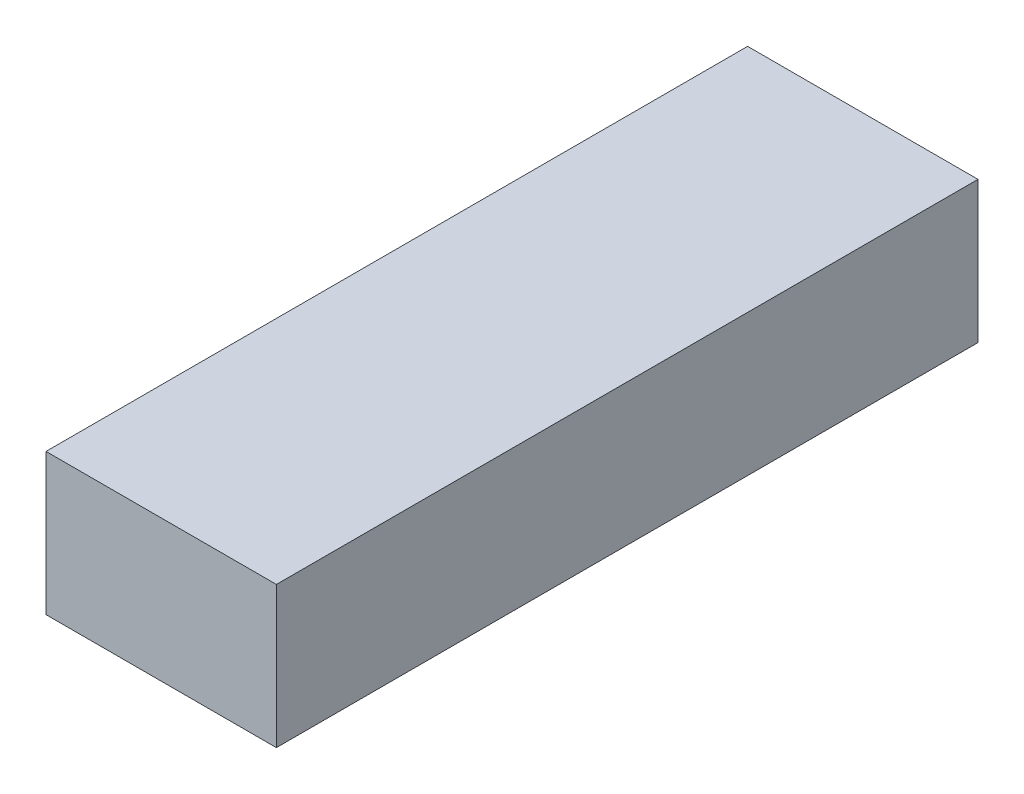
ISO-10303-21;
HEADER;
FILE_DESCRIPTION(('STEP AP214'),'2;1');
FILE_NAME('part.step','',(''),(''),'','','');
FILE_SCHEMA(('AUTOMOTIVE_DESIGN { 1 0 10303 214 1 1 1 1 }'));
ENDSEC;
DATA;
#1=APPLICATION_CONTEXT('core data for automotive mechanical design processes');
#2=APPLICATION_PROTOCOL_DEFINITION('international standard','automotive_design',2000,#1);
#3=PRODUCT_CONTEXT('',#1,'mechanical');
#4=PRODUCT('Part','Part','',(#3));
#5=PRODUCT_RELATED_PRODUCT_CATEGORY('part','',(#4));
#6=PRODUCT_DEFINITION_FORMATION('','',#4);
#7=PRODUCT_DEFINITION_CONTEXT('part definition',#1,'design');
#8=PRODUCT_DEFINITION('design','',#6,#7);
#9=PRODUCT_DEFINITION_SHAPE('','',#8);
#10=(LENGTH_UNIT() NAMED_UNIT(*) SI_UNIT(.MILLI.,.METRE.));
#11=(NAMED_UNIT(*) PLANE_ANGLE_UNIT() SI_UNIT($,.RADIAN.));
#12=(NAMED_UNIT(*) SI_UNIT($,.STERADIAN.) SOLID_ANGLE_UNIT());
#13=UNCERTAINTY_MEASURE_WITH_UNIT(LENGTH_MEASURE(1.E-05),#10,'distance_accuracy_value','');
#14=(GEOMETRIC_REPRESENTATION_CONTEXT(3) GLOBAL_UNCERTAINTY_ASSIGNED_CONTEXT((#13)) GLOBAL_UNIT_ASSIGNED_CONTEXT((#10,
#11,#12)) REPRESENTATION_CONTEXT('',''));
#15=CARTESIAN_POINT('',(0.,0.,0.));
#16=DIRECTION('',(0.,0.,1.));
#17=DIRECTION('',(1.,0.,0.));
#18=AXIS2_PLACEMENT_3D('',#15,#16,#17);
#19=CARTESIAN_POINT('',(22.,-13.5,134.));
#20=DIRECTION('',(-1.,0.,0.));
#21=DIRECTION('',(0.,0.,1.));
#22=AXIS2_PLACEMENT_3D('',#19,#20,#21);
#23=PLANE('',#22);
#24=DIRECTION('',(0.,1.,0.));
#25=VECTOR('',#24,1.);
#26=CARTESIAN_POINT('',(22.,-13.5,0.));
#27=LINE('',#26,#25);
#28=CARTESIAN_POINT('',(22.,-13.5,0.));
#29=VERTEX_POINT('',#28);
#30=CARTESIAN_POINT('',(22.,13.5,0.));
#31=VERTEX_POINT('',#30);
#32=EDGE_CURVE('E96',#29,#31,#27,.T.);
#33=ORIENTED_EDGE('',*,*,#32,.T.);
#34=DIRECTION('',(0.,0.,-1.));
#35=VECTOR('',#34,1.);
#36=CARTESIAN_POINT('',(22.,13.5,134.));
#37=LINE('',#36,#35);
#38=CARTESIAN_POINT('',(22.,13.5,134.));
#39=VERTEX_POINT('',#38);
#40=EDGE_CURVE('E11',#39,#31,#37,.T.);
#41=ORIENTED_EDGE('',*,*,#40,.F.);
#42=DIRECTION('',(0.,1.,0.));
#43=VECTOR('',#42,1.);
#44=CARTESIAN_POINT('',(22.,-13.5,134.));
#45=LINE('',#44,#43);
#46=CARTESIAN_POINT('',(22.,-13.5,134.));
#47=VERTEX_POINT('',#46);
#48=EDGE_CURVE('E84',#47,#39,#45,.T.);
#49=ORIENTED_EDGE('',*,*,#48,.F.);
#50=DIRECTION('',(0.,0.,-1.));
#51=VECTOR('',#50,1.);
#52=CARTESIAN_POINT('',(22.,-13.5,134.));
#53=LINE('',#52,#51);
#54=EDGE_CURVE('E92',#47,#29,#53,.T.);
#55=ORIENTED_EDGE('',*,*,#54,.T.);
#56=EDGE_LOOP('',(#33,#41,#49,#55));
#57=FACE_BOUND('',#56,.T.);
#58=ADVANCED_FACE('F33',(#57),#23,.F.);
#59=CARTESIAN_POINT('',(-22.,13.5,134.));
#60=DIRECTION('',(0.,-1.,0.));
#61=DIRECTION('',(0.,0.,-1.));
#62=AXIS2_PLACEMENT_3D('',#59,#60,#61);
#63=PLANE('',#62);
#64=DIRECTION('',(-1.,0.,0.));
#65=VECTOR('',#64,1.);
#66=CARTESIAN_POINT('',(-22.,13.5,0.));
#67=LINE('',#66,#65);
#68=CARTESIAN_POINT('',(-22.,13.5,0.));
#69=VERTEX_POINT('',#68);
#70=EDGE_CURVE('E88',#31,#69,#67,.T.);
#71=ORIENTED_EDGE('',*,*,#70,.T.);
#72=DIRECTION('',(0.,0.,-1.));
#73=VECTOR('',#72,1.);
#74=CARTESIAN_POINT('',(-22.,13.5,134.));
#75=LINE('',#74,#73);
#76=CARTESIAN_POINT('',(-22.,13.5,134.));
#77=VERTEX_POINT('',#76);
#78=EDGE_CURVE('E41',#77,#69,#75,.T.);
#79=ORIENTED_EDGE('',*,*,#78,.F.);
#80=DIRECTION('',(-1.,0.,0.));
#81=VECTOR('',#80,1.);
#82=CARTESIAN_POINT('',(-22.,13.5,134.));
#83=LINE('',#82,#81);
#84=EDGE_CURVE('E79',#39,#77,#83,.T.);
#85=ORIENTED_EDGE('',*,*,#84,.F.);
#86=ORIENTED_EDGE('',*,*,#40,.T.);
#87=EDGE_LOOP('',(#71,#79,#85,#86));
#88=FACE_BOUND('',#87,.T.);
#89=ADVANCED_FACE('F87',(#88),#63,.F.);
#90=CARTESIAN_POINT('',(-22.,-13.5,134.));
#91=DIRECTION('',(1.,0.,0.));
#92=DIRECTION('',(0.,0.,-1.));
#93=AXIS2_PLACEMENT_3D('',#90,#91,#92);
#94=PLANE('',#93);
#95=DIRECTION('',(0.,-1.,0.));
#96=VECTOR('',#95,1.);
#97=CARTESIAN_POINT('',(-22.,-13.5,0.));
#98=LINE('',#97,#96);
#99=CARTESIAN_POINT('',(-22.,-13.5,0.));
#100=VERTEX_POINT('',#99);
#101=EDGE_CURVE('E66',#69,#100,#98,.T.);
#102=ORIENTED_EDGE('',*,*,#101,.T.);
#103=DIRECTION('',(0.,0.,-1.));
#104=VECTOR('',#103,1.);
#105=CARTESIAN_POINT('',(-22.,-13.5,134.));
#106=LINE('',#105,#104);
#107=CARTESIAN_POINT('',(-22.,-13.5,134.));
#108=VERTEX_POINT('',#107);
#109=EDGE_CURVE('E89',#108,#100,#106,.T.);
#110=ORIENTED_EDGE('',*,*,#109,.F.);
#111=DIRECTION('',(0.,-1.,0.));
#112=VECTOR('',#111,1.);
#113=CARTESIAN_POINT('',(-22.,-13.5,134.));
#114=LINE('',#113,#112);
#115=EDGE_CURVE('E82',#77,#108,#114,.T.);
#116=ORIENTED_EDGE('',*,*,#115,.F.);
#117=ORIENTED_EDGE('',*,*,#78,.T.);
#118=EDGE_LOOP('',(#102,#110,#116,#117));
#119=FACE_BOUND('',#118,.T.);
#120=ADVANCED_FACE('F90',(#119),#94,.F.);
#121=CARTESIAN_POINT('',(-22.,-13.5,134.));
#122=DIRECTION('',(0.,1.,0.));
#123=DIRECTION('',(0.,0.,1.));
#124=AXIS2_PLACEMENT_3D('',#121,#122,#123);
#125=PLANE('',#124);
#126=DIRECTION('',(1.,0.,0.));
#127=VECTOR('',#126,1.);
#128=CARTESIAN_POINT('',(-22.,-13.5,0.));
#129=LINE('',#128,#127);
#130=EDGE_CURVE('E72',#100,#29,#129,.T.);
#131=ORIENTED_EDGE('',*,*,#130,.T.);
#132=ORIENTED_EDGE('',*,*,#54,.F.);
#133=DIRECTION('',(1.,0.,0.));
#134=VECTOR('',#133,1.);
#135=CARTESIAN_POINT('',(-22.,-13.5,134.));
#136=LINE('',#135,#134);
#137=EDGE_CURVE('E49',#108,#47,#136,.T.);
#138=ORIENTED_EDGE('',*,*,#137,.F.);
#139=ORIENTED_EDGE('',*,*,#109,.T.);
#140=EDGE_LOOP('',(#131,#132,#138,#139));
#141=FACE_BOUND('',#140,.T.);
#142=ADVANCED_FACE('F103',(#141),#125,.F.);
#143=CARTESIAN_POINT('',(0.,0.,134.));
#144=DIRECTION('',(0.,0.,-1.));
#145=DIRECTION('',(-1.,0.,0.));
#146=AXIS2_PLACEMENT_3D('',#143,#144,#145);
#147=PLANE('',#146);
#148=ORIENTED_EDGE('',*,*,#48,.T.);
#149=ORIENTED_EDGE('',*,*,#84,.T.);
#150=ORIENTED_EDGE('',*,*,#115,.T.);
#151=ORIENTED_EDGE('',*,*,#137,.T.);
#152=EDGE_LOOP('',(#148,#149,#150,#151));
#153=FACE_BOUND('',#152,.T.);
#154=ADVANCED_FACE('F80',(#153),#147,.F.);
#155=CARTESIAN_POINT('',(0.,0.,0.));
#156=DIRECTION('',(0.,0.,-1.));
#157=DIRECTION('',(-1.,0.,0.));
#158=AXIS2_PLACEMENT_3D('',#155,#156,#157);
#159=PLANE('',#158);
#160=ORIENTED_EDGE('',*,*,#32,.F.);
#161=ORIENTED_EDGE('',*,*,#130,.F.);
#162=ORIENTED_EDGE('',*,*,#101,.F.);
#163=ORIENTED_EDGE('',*,*,#70,.F.);
#164=EDGE_LOOP('',(#160,#161,#162,#163));
#165=FACE_BOUND('',#164,.T.);
#166=ADVANCED_FACE('F106',(#165),#159,.T.);
#167=CLOSED_SHELL('',(#58,#89,#120,#142,#154,#166));
#168=MANIFOLD_SOLID_BREP('B2',#167);
#169=ADVANCED_BREP_SHAPE_REPRESENTATION('',(#18,#168),#14);
#170=SHAPE_DEFINITION_REPRESENTATION(#9,#169);
ENDSEC;
END-ISO-10303-21;
